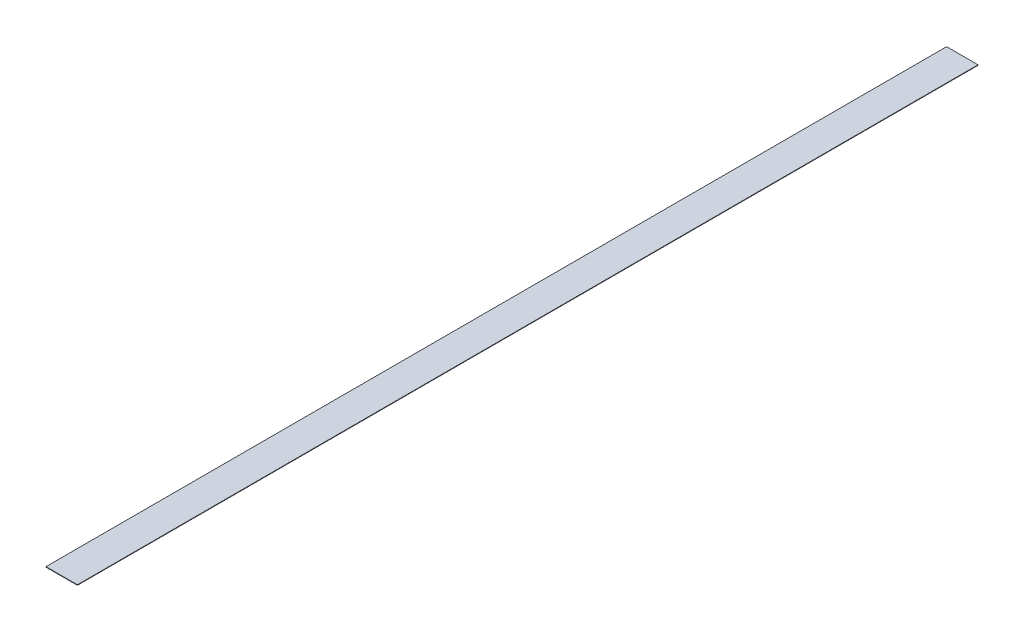
ISO-10303-21;
HEADER;
FILE_DESCRIPTION(('STEP AP214'),'2;1');
FILE_NAME('part.step','',(''),(''),'','','');
FILE_SCHEMA(('AUTOMOTIVE_DESIGN { 1 0 10303 214 1 1 1 1 }'));
ENDSEC;
DATA;
#1=APPLICATION_CONTEXT('core data for automotive mechanical design processes');
#2=APPLICATION_PROTOCOL_DEFINITION('international standard','automotive_design',2000,#1);
#3=PRODUCT_CONTEXT('',#1,'mechanical');
#4=PRODUCT('Part','Part','',(#3));
#5=PRODUCT_RELATED_PRODUCT_CATEGORY('part','',(#4));
#6=PRODUCT_DEFINITION_FORMATION('','',#4);
#7=PRODUCT_DEFINITION_CONTEXT('part definition',#1,'design');
#8=PRODUCT_DEFINITION('design','',#6,#7);
#9=PRODUCT_DEFINITION_SHAPE('','',#8);
#10=(LENGTH_UNIT() NAMED_UNIT(*) SI_UNIT(.MILLI.,.METRE.));
#11=(NAMED_UNIT(*) PLANE_ANGLE_UNIT() SI_UNIT($,.RADIAN.));
#12=(NAMED_UNIT(*) SI_UNIT($,.STERADIAN.) SOLID_ANGLE_UNIT());
#13=UNCERTAINTY_MEASURE_WITH_UNIT(LENGTH_MEASURE(1.E-05),#10,'distance_accuracy_value','');
#14=(GEOMETRIC_REPRESENTATION_CONTEXT(3) GLOBAL_UNCERTAINTY_ASSIGNED_CONTEXT((#13)) GLOBAL_UNIT_ASSIGNED_CONTEXT((#10,
#11,#12)) REPRESENTATION_CONTEXT('',''));
#15=CARTESIAN_POINT('',(0.,0.,0.));
#16=DIRECTION('',(0.,0.,1.));
#17=DIRECTION('',(1.,0.,0.));
#18=AXIS2_PLACEMENT_3D('',#15,#16,#17);
#19=CARTESIAN_POINT('',(25.3999999999999,0.79375,-728.6625));
#20=DIRECTION('',(-1.,0.,0.));
#21=DIRECTION('',(0.,0.,1.));
#22=AXIS2_PLACEMENT_3D('',#19,#20,#21);
#23=PLANE('',#22);
#24=DIRECTION('',(0.,0.,-1.));
#25=VECTOR('',#24,1.);
#26=CARTESIAN_POINT('',(25.3999999999999,0.,-728.6625));
#27=LINE('',#26,#25);
#28=CARTESIAN_POINT('',(25.4000000000001,0.,728.6625));
#29=VERTEX_POINT('',#28);
#30=CARTESIAN_POINT('',(25.3999999999999,0.,-728.6625));
#31=VERTEX_POINT('',#30);
#32=EDGE_CURVE('E96',#29,#31,#27,.T.);
#33=ORIENTED_EDGE('',*,*,#32,.T.);
#34=DIRECTION('',(0.,-1.,0.));
#35=VECTOR('',#34,1.);
#36=CARTESIAN_POINT('',(25.3999999999999,0.79375,-728.6625));
#37=LINE('',#36,#35);
#38=CARTESIAN_POINT('',(25.3999999999999,0.79375,-728.6625));
#39=VERTEX_POINT('',#38);
#40=EDGE_CURVE('E11',#39,#31,#37,.T.);
#41=ORIENTED_EDGE('',*,*,#40,.F.);
#42=DIRECTION('',(0.,0.,-1.));
#43=VECTOR('',#42,1.);
#44=CARTESIAN_POINT('',(25.3999999999999,0.79375,-728.6625));
#45=LINE('',#44,#43);
#46=CARTESIAN_POINT('',(25.4000000000001,0.79375,728.6625));
#47=VERTEX_POINT('',#46);
#48=EDGE_CURVE('E84',#47,#39,#45,.T.);
#49=ORIENTED_EDGE('',*,*,#48,.F.);
#50=DIRECTION('',(0.,-1.,0.));
#51=VECTOR('',#50,1.);
#52=CARTESIAN_POINT('',(25.4000000000001,0.79375,728.6625));
#53=LINE('',#52,#51);
#54=EDGE_CURVE('E92',#47,#29,#53,.T.);
#55=ORIENTED_EDGE('',*,*,#54,.T.);
#56=EDGE_LOOP('',(#33,#41,#49,#55));
#57=FACE_BOUND('',#56,.T.);
#58=ADVANCED_FACE('F33',(#57),#23,.F.);
#59=CARTESIAN_POINT('',(-25.4000000000001,0.79375,-728.6625));
#60=DIRECTION('',(0.,0.,1.));
#61=DIRECTION('',(1.,0.,0.));
#62=AXIS2_PLACEMENT_3D('',#59,#60,#61);
#63=PLANE('',#62);
#64=DIRECTION('',(-1.,0.,0.));
#65=VECTOR('',#64,1.);
#66=CARTESIAN_POINT('',(-25.4000000000001,0.,-728.6625));
#67=LINE('',#66,#65);
#68=CARTESIAN_POINT('',(-25.4000000000001,0.,-728.6625));
#69=VERTEX_POINT('',#68);
#70=EDGE_CURVE('E88',#31,#69,#67,.T.);
#71=ORIENTED_EDGE('',*,*,#70,.T.);
#72=DIRECTION('',(0.,-1.,0.));
#73=VECTOR('',#72,1.);
#74=CARTESIAN_POINT('',(-25.4000000000001,0.79375,-728.6625));
#75=LINE('',#74,#73);
#76=CARTESIAN_POINT('',(-25.4000000000001,0.79375,-728.6625));
#77=VERTEX_POINT('',#76);
#78=EDGE_CURVE('E41',#77,#69,#75,.T.);
#79=ORIENTED_EDGE('',*,*,#78,.F.);
#80=DIRECTION('',(-1.,0.,0.));
#81=VECTOR('',#80,1.);
#82=CARTESIAN_POINT('',(-25.4000000000001,0.79375,-728.6625));
#83=LINE('',#82,#81);
#84=EDGE_CURVE('E79',#39,#77,#83,.T.);
#85=ORIENTED_EDGE('',*,*,#84,.F.);
#86=ORIENTED_EDGE('',*,*,#40,.T.);
#87=EDGE_LOOP('',(#71,#79,#85,#86));
#88=FACE_BOUND('',#87,.T.);
#89=ADVANCED_FACE('F87',(#88),#63,.F.);
#90=CARTESIAN_POINT('',(-25.4000000000001,0.79375,-728.6625));
#91=DIRECTION('',(1.,0.,0.));
#92=DIRECTION('',(0.,0.,-1.));
#93=AXIS2_PLACEMENT_3D('',#90,#91,#92);
#94=PLANE('',#93);
#95=DIRECTION('',(0.,0.,1.));
#96=VECTOR('',#95,1.);
#97=CARTESIAN_POINT('',(-25.4000000000001,0.,-728.6625));
#98=LINE('',#97,#96);
#99=CARTESIAN_POINT('',(-25.3999999999999,0.,728.6625));
#100=VERTEX_POINT('',#99);
#101=EDGE_CURVE('E66',#69,#100,#98,.T.);
#102=ORIENTED_EDGE('',*,*,#101,.T.);
#103=DIRECTION('',(0.,-1.,0.));
#104=VECTOR('',#103,1.);
#105=CARTESIAN_POINT('',(-25.3999999999999,0.79375,728.6625));
#106=LINE('',#105,#104);
#107=CARTESIAN_POINT('',(-25.3999999999999,0.79375,728.6625));
#108=VERTEX_POINT('',#107);
#109=EDGE_CURVE('E89',#108,#100,#106,.T.);
#110=ORIENTED_EDGE('',*,*,#109,.F.);
#111=DIRECTION('',(0.,0.,1.));
#112=VECTOR('',#111,1.);
#113=CARTESIAN_POINT('',(-25.4000000000001,0.79375,-728.6625));
#114=LINE('',#113,#112);
#115=EDGE_CURVE('E82',#77,#108,#114,.T.);
#116=ORIENTED_EDGE('',*,*,#115,.F.);
#117=ORIENTED_EDGE('',*,*,#78,.T.);
#118=EDGE_LOOP('',(#102,#110,#116,#117));
#119=FACE_BOUND('',#118,.T.);
#120=ADVANCED_FACE('F90',(#119),#94,.F.);
#121=CARTESIAN_POINT('',(-25.3999999999999,0.79375,728.6625));
#122=DIRECTION('',(0.,0.,-1.));
#123=DIRECTION('',(-1.,0.,0.));
#124=AXIS2_PLACEMENT_3D('',#121,#122,#123);
#125=PLANE('',#124);
#126=DIRECTION('',(1.,0.,0.));
#127=VECTOR('',#126,1.);
#128=CARTESIAN_POINT('',(-25.3999999999999,0.,728.6625));
#129=LINE('',#128,#127);
#130=EDGE_CURVE('E72',#100,#29,#129,.T.);
#131=ORIENTED_EDGE('',*,*,#130,.T.);
#132=ORIENTED_EDGE('',*,*,#54,.F.);
#133=DIRECTION('',(1.,0.,0.));
#134=VECTOR('',#133,1.);
#135=CARTESIAN_POINT('',(-25.3999999999999,0.79375,728.6625));
#136=LINE('',#135,#134);
#137=EDGE_CURVE('E49',#108,#47,#136,.T.);
#138=ORIENTED_EDGE('',*,*,#137,.F.);
#139=ORIENTED_EDGE('',*,*,#109,.T.);
#140=EDGE_LOOP('',(#131,#132,#138,#139));
#141=FACE_BOUND('',#140,.T.);
#142=ADVANCED_FACE('F103',(#141),#125,.F.);
#143=CARTESIAN_POINT('',(0.,0.79375,0.));
#144=DIRECTION('',(0.,1.,0.));
#145=DIRECTION('',(0.,0.,1.));
#146=AXIS2_PLACEMENT_3D('',#143,#144,#145);
#147=PLANE('',#146);
#148=ORIENTED_EDGE('',*,*,#48,.T.);
#149=ORIENTED_EDGE('',*,*,#84,.T.);
#150=ORIENTED_EDGE('',*,*,#115,.T.);
#151=ORIENTED_EDGE('',*,*,#137,.T.);
#152=EDGE_LOOP('',(#148,#149,#150,#151));
#153=FACE_BOUND('',#152,.T.);
#154=ADVANCED_FACE('F80',(#153),#147,.T.);
#155=CARTESIAN_POINT('',(0.,0.,0.));
#156=DIRECTION('',(0.,1.,0.));
#157=DIRECTION('',(0.,0.,1.));
#158=AXIS2_PLACEMENT_3D('',#155,#156,#157);
#159=PLANE('',#158);
#160=ORIENTED_EDGE('',*,*,#32,.F.);
#161=ORIENTED_EDGE('',*,*,#130,.F.);
#162=ORIENTED_EDGE('',*,*,#101,.F.);
#163=ORIENTED_EDGE('',*,*,#70,.F.);
#164=EDGE_LOOP('',(#160,#161,#162,#163));
#165=FACE_BOUND('',#164,.T.);
#166=ADVANCED_FACE('F106',(#165),#159,.F.);
#167=CLOSED_SHELL('',(#58,#89,#120,#142,#154,#166));
#168=MANIFOLD_SOLID_BREP('B2',#167);
#169=ADVANCED_BREP_SHAPE_REPRESENTATION('',(#18,#168),#14);
#170=SHAPE_DEFINITION_REPRESENTATION(#9,#169);
ENDSEC;
END-ISO-10303-21;
